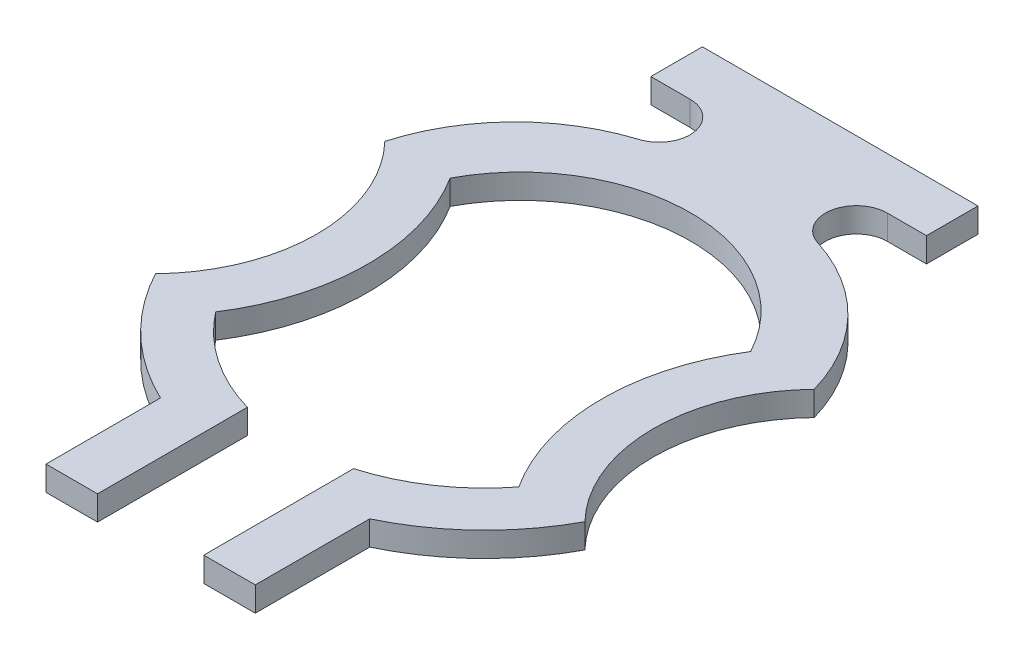
ISO-10303-21;
HEADER;
FILE_DESCRIPTION(('STEP AP214'),'2;1');
FILE_NAME('part.step','',(''),(''),'','','');
FILE_SCHEMA(('AUTOMOTIVE_DESIGN { 1 0 10303 214 1 1 1 1 }'));
ENDSEC;
DATA;
#1=APPLICATION_CONTEXT('core data for automotive mechanical design processes');
#2=APPLICATION_PROTOCOL_DEFINITION('international standard','automotive_design',2000,#1);
#3=PRODUCT_CONTEXT('',#1,'mechanical');
#4=PRODUCT('Part','Part','',(#3));
#5=PRODUCT_RELATED_PRODUCT_CATEGORY('part','',(#4));
#6=PRODUCT_DEFINITION_FORMATION('','',#4);
#7=PRODUCT_DEFINITION_CONTEXT('part definition',#1,'design');
#8=PRODUCT_DEFINITION('design','',#6,#7);
#9=PRODUCT_DEFINITION_SHAPE('','',#8);
#10=(LENGTH_UNIT() NAMED_UNIT(*) SI_UNIT(.MILLI.,.METRE.));
#11=(NAMED_UNIT(*) PLANE_ANGLE_UNIT() SI_UNIT($,.RADIAN.));
#12=(NAMED_UNIT(*) SI_UNIT($,.STERADIAN.) SOLID_ANGLE_UNIT());
#13=UNCERTAINTY_MEASURE_WITH_UNIT(LENGTH_MEASURE(1.E-05),#10,'distance_accuracy_value','');
#14=(GEOMETRIC_REPRESENTATION_CONTEXT(3) GLOBAL_UNCERTAINTY_ASSIGNED_CONTEXT((#13)) GLOBAL_UNIT_ASSIGNED_CONTEXT((#10,
#11,#12)) REPRESENTATION_CONTEXT('',''));
#15=CARTESIAN_POINT('',(0.,0.,0.));
#16=DIRECTION('',(0.,0.,1.));
#17=DIRECTION('',(1.,0.,0.));
#18=AXIS2_PLACEMENT_3D('',#15,#16,#17);
#19=CARTESIAN_POINT('',(0.,0.1,-0.1447));
#20=DIRECTION('',(0.,-1.,0.));
#21=DIRECTION('',(0.,0.,-1.));
#22=AXIS2_PLACEMENT_3D('',#19,#20,#21);
#23=CYLINDRICAL_SURFACE('',#22,0.6938);
#24=CARTESIAN_POINT('',(0.,0.,-0.1447));
#25=DIRECTION('',(0.,-1.,0.));
#26=DIRECTION('',(0.,0.,1.));
#27=AXIS2_PLACEMENT_3D('',#24,#25,#26);
#28=CIRCLE('',#27,0.6938);
#29=CARTESIAN_POINT('',(-0.612334437623996,0.,-0.470897756736163));
#30=VERTEX_POINT('',#29);
#31=CARTESIAN_POINT('',(0.612334437623996,0.,-0.470897756736163));
#32=VERTEX_POINT('',#31);
#33=EDGE_CURVE('E227',#30,#32,#28,.T.);
#34=ORIENTED_EDGE('',*,*,#33,.T.);
#35=DIRECTION('',(0.,-1.,0.));
#36=VECTOR('',#35,1.);
#37=CARTESIAN_POINT('',(0.612334437623996,0.1,-0.470897756736163));
#38=LINE('',#37,#36);
#39=CARTESIAN_POINT('',(0.612334437623996,0.1,-0.470897756736163));
#40=VERTEX_POINT('',#39);
#41=EDGE_CURVE('E11',#40,#32,#38,.T.);
#42=ORIENTED_EDGE('',*,*,#41,.F.);
#43=CARTESIAN_POINT('',(0.,0.1,-0.1447));
#44=DIRECTION('',(0.,-1.,0.));
#45=DIRECTION('',(0.,0.,1.));
#46=AXIS2_PLACEMENT_3D('',#43,#44,#45);
#47=CIRCLE('',#46,0.6938);
#48=CARTESIAN_POINT('',(-0.612334437623996,0.1,-0.470897756736163));
#49=VERTEX_POINT('',#48);
#50=EDGE_CURVE('E273',#49,#40,#47,.T.);
#51=ORIENTED_EDGE('',*,*,#50,.F.);
#52=DIRECTION('',(0.,-1.,0.));
#53=VECTOR('',#52,1.);
#54=CARTESIAN_POINT('',(-0.612334437623996,0.1,-0.470897756736163));
#55=LINE('',#54,#53);
#56=EDGE_CURVE('E223',#49,#30,#55,.T.);
#57=ORIENTED_EDGE('',*,*,#56,.T.);
#58=EDGE_LOOP('',(#34,#42,#51,#57));
#59=FACE_BOUND('',#58,.T.);
#60=ADVANCED_FACE('F35',(#59),#23,.F.);
#61=CARTESIAN_POINT('',(1.3587,0.1,0.));
#62=DIRECTION('',(0.,-1.,0.));
#63=DIRECTION('',(0.,0.,-1.));
#64=AXIS2_PLACEMENT_3D('',#61,#62,#63);
#65=CYLINDRICAL_SURFACE('',#64,0.8825);
#66=CARTESIAN_POINT('',(1.3587,0.,0.));
#67=DIRECTION('',(0.,1.,0.));
#68=DIRECTION('',(0.,0.,1.));
#69=AXIS2_PLACEMENT_3D('',#66,#67,#68);
#70=CIRCLE('',#69,0.8825);
#71=CARTESIAN_POINT('',(0.617847887686759,0.,0.47952517940251));
#72=VERTEX_POINT('',#71);
#73=EDGE_CURVE('E230',#32,#72,#70,.T.);
#74=ORIENTED_EDGE('',*,*,#73,.T.);
#75=DIRECTION('',(0.,-1.,0.));
#76=VECTOR('',#75,1.);
#77=CARTESIAN_POINT('',(0.617847887686759,0.1,0.47952517940251));
#78=LINE('',#77,#76);
#79=CARTESIAN_POINT('',(0.617847887686759,0.1,0.47952517940251));
#80=VERTEX_POINT('',#79);
#81=EDGE_CURVE('E43',#80,#72,#78,.T.);
#82=ORIENTED_EDGE('',*,*,#81,.F.);
#83=CARTESIAN_POINT('',(1.3587,0.1,0.));
#84=DIRECTION('',(0.,1.,0.));
#85=DIRECTION('',(0.,0.,1.));
#86=AXIS2_PLACEMENT_3D('',#83,#84,#85);
#87=CIRCLE('',#86,0.8825);
#88=EDGE_CURVE('E142',#40,#80,#87,.T.);
#89=ORIENTED_EDGE('',*,*,#88,.F.);
#90=ORIENTED_EDGE('',*,*,#41,.T.);
#91=EDGE_LOOP('',(#74,#82,#89,#90));
#92=FACE_BOUND('',#91,.T.);
#93=ADVANCED_FACE('F411',(#92),#65,.T.);
#94=CARTESIAN_POINT('',(0.,0.1,0.));
#95=DIRECTION('',(0.,-1.,0.));
#96=DIRECTION('',(0.,0.,-1.));
#97=AXIS2_PLACEMENT_3D('',#94,#95,#96);
#98=CYLINDRICAL_SURFACE('',#97,0.7821);
#99=CARTESIAN_POINT('',(0.,0.,0.));
#100=DIRECTION('',(0.,-1.,0.));
#101=DIRECTION('',(0.,0.,1.));
#102=AXIS2_PLACEMENT_3D('',#99,#100,#101);
#103=CIRCLE('',#102,0.7821);
#104=CARTESIAN_POINT('',(0.2165,0.,0.751537198014842));
#105=VERTEX_POINT('',#104);
#106=EDGE_CURVE('E232',#72,#105,#103,.T.);
#107=ORIENTED_EDGE('',*,*,#106,.T.);
#108=DIRECTION('',(0.,-1.,0.));
#109=VECTOR('',#108,1.);
#110=CARTESIAN_POINT('',(0.2165,0.1,0.751537198014842));
#111=LINE('',#110,#109);
#112=CARTESIAN_POINT('',(0.2165,0.1,0.751537198014842));
#113=VERTEX_POINT('',#112);
#114=EDGE_CURVE('E328',#113,#105,#111,.T.);
#115=ORIENTED_EDGE('',*,*,#114,.F.);
#116=CARTESIAN_POINT('',(0.,0.1,0.));
#117=DIRECTION('',(0.,-1.,0.));
#118=DIRECTION('',(0.,0.,1.));
#119=AXIS2_PLACEMENT_3D('',#116,#117,#118);
#120=CIRCLE('',#119,0.7821);
#121=EDGE_CURVE('E336',#80,#113,#120,.T.);
#122=ORIENTED_EDGE('',*,*,#121,.F.);
#123=ORIENTED_EDGE('',*,*,#81,.T.);
#124=EDGE_LOOP('',(#107,#115,#122,#123));
#125=FACE_BOUND('',#124,.T.);
#126=ADVANCED_FACE('F334',(#125),#98,.F.);
#127=CARTESIAN_POINT('',(0.2165,0.1,0.751537198014842));
#128=DIRECTION('',(1.,0.,0.));
#129=DIRECTION('',(0.,0.,-1.));
#130=AXIS2_PLACEMENT_3D('',#127,#128,#129);
#131=PLANE('',#130);
#132=DIRECTION('',(0.,0.,1.));
#133=VECTOR('',#132,1.);
#134=CARTESIAN_POINT('',(0.2165,0.,0.751537198014842));
#135=LINE('',#134,#133);
#136=CARTESIAN_POINT('',(0.216499999999953,0.,1.3623));
#137=VERTEX_POINT('',#136);
#138=EDGE_CURVE('E234',#105,#137,#135,.T.);
#139=ORIENTED_EDGE('',*,*,#138,.T.);
#140=DIRECTION('',(0.,-1.,0.));
#141=VECTOR('',#140,1.);
#142=CARTESIAN_POINT('',(0.216499999999953,0.1,1.3623));
#143=LINE('',#142,#141);
#144=CARTESIAN_POINT('',(0.216499999999953,0.1,1.3623));
#145=VERTEX_POINT('',#144);
#146=EDGE_CURVE('E325',#145,#137,#143,.T.);
#147=ORIENTED_EDGE('',*,*,#146,.F.);
#148=DIRECTION('',(0.,0.,1.));
#149=VECTOR('',#148,1.);
#150=CARTESIAN_POINT('',(0.2165,0.1,0.751537198014842));
#151=LINE('',#150,#149);
#152=EDGE_CURVE('E354',#113,#145,#151,.T.);
#153=ORIENTED_EDGE('',*,*,#152,.F.);
#154=ORIENTED_EDGE('',*,*,#114,.T.);
#155=EDGE_LOOP('',(#139,#147,#153,#154));
#156=FACE_BOUND('',#155,.T.);
#157=ADVANCED_FACE('F345',(#156),#131,.F.);
#158=CARTESIAN_POINT('',(0.216499999999953,0.1,1.3623));
#159=DIRECTION('',(0.,0.,-1.));
#160=DIRECTION('',(-1.,0.,0.));
#161=AXIS2_PLACEMENT_3D('',#158,#159,#160);
#162=PLANE('',#161);
#163=DIRECTION('',(1.,0.,0.));
#164=VECTOR('',#163,1.);
#165=CARTESIAN_POINT('',(0.216499999999953,0.,1.3623));
#166=LINE('',#165,#164);
#167=CARTESIAN_POINT('',(0.4265,0.,1.3623));
#168=VERTEX_POINT('',#167);
#169=EDGE_CURVE('E236',#137,#168,#166,.T.);
#170=ORIENTED_EDGE('',*,*,#169,.T.);
#171=DIRECTION('',(0.,-1.,0.));
#172=VECTOR('',#171,1.);
#173=CARTESIAN_POINT('',(0.4265,0.1,1.3623));
#174=LINE('',#173,#172);
#175=CARTESIAN_POINT('',(0.4265,0.1,1.3623));
#176=VERTEX_POINT('',#175);
#177=EDGE_CURVE('E322',#176,#168,#174,.T.);
#178=ORIENTED_EDGE('',*,*,#177,.F.);
#179=DIRECTION('',(1.,0.,0.));
#180=VECTOR('',#179,1.);
#181=CARTESIAN_POINT('',(0.216499999999953,0.1,1.3623));
#182=LINE('',#181,#180);
#183=EDGE_CURVE('E351',#145,#176,#182,.T.);
#184=ORIENTED_EDGE('',*,*,#183,.F.);
#185=ORIENTED_EDGE('',*,*,#146,.T.);
#186=EDGE_LOOP('',(#170,#178,#184,#185));
#187=FACE_BOUND('',#186,.T.);
#188=ADVANCED_FACE('F349',(#187),#162,.F.);
#189=CARTESIAN_POINT('',(0.4265,0.1,1.3623));
#190=DIRECTION('',(-1.,0.,0.));
#191=DIRECTION('',(0.,0.,1.));
#192=AXIS2_PLACEMENT_3D('',#189,#190,#191);
#193=PLANE('',#192);
#194=DIRECTION('',(0.,0.,-1.));
#195=VECTOR('',#194,1.);
#196=CARTESIAN_POINT('',(0.4265,0.,1.3623));
#197=LINE('',#196,#195);
#198=CARTESIAN_POINT('',(0.4265,0.,0.895745588881129));
#199=VERTEX_POINT('',#198);
#200=EDGE_CURVE('E238',#168,#199,#197,.T.);
#201=ORIENTED_EDGE('',*,*,#200,.T.);
#202=DIRECTION('',(0.,-1.,0.));
#203=VECTOR('',#202,1.);
#204=CARTESIAN_POINT('',(0.4265,0.1,0.895745588881129));
#205=LINE('',#204,#203);
#206=CARTESIAN_POINT('',(0.4265,0.1,0.895745588881129));
#207=VERTEX_POINT('',#206);
#208=EDGE_CURVE('E319',#207,#199,#205,.T.);
#209=ORIENTED_EDGE('',*,*,#208,.F.);
#210=DIRECTION('',(0.,0.,-1.));
#211=VECTOR('',#210,1.);
#212=CARTESIAN_POINT('',(0.4265,0.1,1.3623));
#213=LINE('',#212,#211);
#214=EDGE_CURVE('E353',#176,#207,#213,.T.);
#215=ORIENTED_EDGE('',*,*,#214,.F.);
#216=ORIENTED_EDGE('',*,*,#177,.T.);
#217=EDGE_LOOP('',(#201,#209,#215,#216));
#218=FACE_BOUND('',#217,.T.);
#219=ADVANCED_FACE('F424',(#218),#193,.F.);
#220=CARTESIAN_POINT('',(0.,0.1,0.));
#221=DIRECTION('',(0.,-1.,0.));
#222=DIRECTION('',(0.,0.,-1.));
#223=AXIS2_PLACEMENT_3D('',#220,#221,#222);
#224=CYLINDRICAL_SURFACE('',#223,0.9921);
#225=CARTESIAN_POINT('',(0.,0.,0.));
#226=DIRECTION('',(0.,1.,0.));
#227=DIRECTION('',(0.,0.,1.));
#228=AXIS2_PLACEMENT_3D('',#225,#226,#227);
#229=CIRCLE('',#228,0.9921);
#230=CARTESIAN_POINT('',(0.875127640391551,0.,0.467347860830363));
#231=VERTEX_POINT('',#230);
#232=EDGE_CURVE('E240',#199,#231,#229,.T.);
#233=ORIENTED_EDGE('',*,*,#232,.T.);
#234=DIRECTION('',(0.,-1.,0.));
#235=VECTOR('',#234,1.);
#236=CARTESIAN_POINT('',(0.875127640391551,0.1,0.467347860830363));
#237=LINE('',#236,#235);
#238=CARTESIAN_POINT('',(0.875127640391551,0.1,0.467347860830363));
#239=VERTEX_POINT('',#238);
#240=EDGE_CURVE('E316',#239,#231,#237,.T.);
#241=ORIENTED_EDGE('',*,*,#240,.F.);
#242=CARTESIAN_POINT('',(0.,0.1,0.));
#243=DIRECTION('',(0.,1.,0.));
#244=DIRECTION('',(0.,0.,1.));
#245=AXIS2_PLACEMENT_3D('',#242,#243,#244);
#246=CIRCLE('',#245,0.9921);
#247=EDGE_CURVE('E356',#207,#239,#246,.T.);
#248=ORIENTED_EDGE('',*,*,#247,.F.);
#249=ORIENTED_EDGE('',*,*,#208,.T.);
#250=EDGE_LOOP('',(#233,#241,#248,#249));
#251=FACE_BOUND('',#250,.T.);
#252=ADVANCED_FACE('F427',(#251),#224,.T.);
#253=CARTESIAN_POINT('',(1.3587,0.1,0.));
#254=DIRECTION('',(0.,-1.,0.));
#255=DIRECTION('',(0.,0.,-1.));
#256=AXIS2_PLACEMENT_3D('',#253,#254,#255);
#257=CYLINDRICAL_SURFACE('',#256,0.6725);
#258=CARTESIAN_POINT('',(1.3587,0.,0.));
#259=DIRECTION('',(0.,-1.,0.));
#260=DIRECTION('',(0.,0.,1.));
#261=AXIS2_PLACEMENT_3D('',#258,#259,#260);
#262=CIRCLE('',#261,0.6725);
#263=CARTESIAN_POINT('',(0.875117893320699,0.,-0.467337775168678));
#264=VERTEX_POINT('',#263);
#265=EDGE_CURVE('E242',#231,#264,#262,.T.);
#266=ORIENTED_EDGE('',*,*,#265,.T.);
#267=DIRECTION('',(0.,-1.,0.));
#268=VECTOR('',#267,1.);
#269=CARTESIAN_POINT('',(0.875117893320699,0.1,-0.467337775168678));
#270=LINE('',#269,#268);
#271=CARTESIAN_POINT('',(0.875117893320699,0.1,-0.467337775168678));
#272=VERTEX_POINT('',#271);
#273=EDGE_CURVE('E313',#272,#264,#270,.T.);
#274=ORIENTED_EDGE('',*,*,#273,.F.);
#275=CARTESIAN_POINT('',(1.3587,0.1,0.));
#276=DIRECTION('',(0.,-1.,0.));
#277=DIRECTION('',(0.,0.,1.));
#278=AXIS2_PLACEMENT_3D('',#275,#276,#277);
#279=CIRCLE('',#278,0.6725);
#280=EDGE_CURVE('E362',#239,#272,#279,.T.);
#281=ORIENTED_EDGE('',*,*,#280,.F.);
#282=ORIENTED_EDGE('',*,*,#240,.T.);
#283=EDGE_LOOP('',(#266,#274,#281,#282));
#284=FACE_BOUND('',#283,.T.);
#285=ADVANCED_FACE('F431',(#284),#257,.F.);
#286=CARTESIAN_POINT('',(0.132599999999927,0.1,-0.2553));
#287=DIRECTION('',(0.,-1.,0.));
#288=DIRECTION('',(0.,0.,-1.));
#289=AXIS2_PLACEMENT_3D('',#286,#287,#288);
#290=CYLINDRICAL_SURFACE('',#289,0.7722);
#291=CARTESIAN_POINT('',(0.132599999999927,0.,-0.2553));
#292=DIRECTION('',(0.,1.,0.));
#293=DIRECTION('',(0.,0.,1.));
#294=AXIS2_PLACEMENT_3D('',#291,#292,#293);
#295=CIRCLE('',#294,0.7722);
#296=CARTESIAN_POINT('',(0.364324457071019,0.,-0.991911577424023));
#297=VERTEX_POINT('',#296);
#298=EDGE_CURVE('E244',#264,#297,#295,.T.);
#299=ORIENTED_EDGE('',*,*,#298,.T.);
#300=DIRECTION('',(0.,-1.,0.));
#301=VECTOR('',#300,1.);
#302=CARTESIAN_POINT('',(0.364324457071019,0.1,-0.991911577424023));
#303=LINE('',#302,#301);
#304=CARTESIAN_POINT('',(0.364324457071019,0.1,-0.991911577424023));
#305=VERTEX_POINT('',#304);
#306=EDGE_CURVE('E310',#305,#297,#303,.T.);
#307=ORIENTED_EDGE('',*,*,#306,.F.);
#308=CARTESIAN_POINT('',(0.132599999999927,0.1,-0.2553));
#309=DIRECTION('',(0.,1.,0.));
#310=DIRECTION('',(0.,0.,1.));
#311=AXIS2_PLACEMENT_3D('',#308,#309,#310);
#312=CIRCLE('',#311,0.7722);
#313=EDGE_CURVE('E364',#272,#305,#312,.T.);
#314=ORIENTED_EDGE('',*,*,#313,.F.);
#315=ORIENTED_EDGE('',*,*,#273,.T.);
#316=EDGE_LOOP('',(#299,#307,#314,#315));
#317=FACE_BOUND('',#316,.T.);
#318=ADVANCED_FACE('F435',(#317),#290,.T.);
#319=CARTESIAN_POINT('',(0.402164982889026,0.1,-1.1122));
#320=DIRECTION('',(0.,-1.,0.));
#321=DIRECTION('',(0.,0.,-1.));
#322=AXIS2_PLACEMENT_3D('',#319,#320,#321);
#323=CYLINDRICAL_SURFACE('',#322,0.1261);
#324=CARTESIAN_POINT('',(0.402164982889026,0.,-1.1122));
#325=DIRECTION('',(0.,-1.,0.));
#326=DIRECTION('',(0.,0.,1.));
#327=AXIS2_PLACEMENT_3D('',#324,#325,#326);
#328=CIRCLE('',#327,0.1261);
#329=CARTESIAN_POINT('',(0.402164982889026,0.,-1.2383));
#330=VERTEX_POINT('',#329);
#331=EDGE_CURVE('E246',#297,#330,#328,.T.);
#332=ORIENTED_EDGE('',*,*,#331,.T.);
#333=DIRECTION('',(0.,-1.,0.));
#334=VECTOR('',#333,1.);
#335=CARTESIAN_POINT('',(0.402164982889026,0.1,-1.2383));
#336=LINE('',#335,#334);
#337=CARTESIAN_POINT('',(0.402164982889026,0.1,-1.2383));
#338=VERTEX_POINT('',#337);
#339=EDGE_CURVE('E307',#338,#330,#336,.T.);
#340=ORIENTED_EDGE('',*,*,#339,.F.);
#341=CARTESIAN_POINT('',(0.402164982889026,0.1,-1.1122));
#342=DIRECTION('',(0.,-1.,0.));
#343=DIRECTION('',(0.,0.,1.));
#344=AXIS2_PLACEMENT_3D('',#341,#342,#343);
#345=CIRCLE('',#344,0.1261);
#346=EDGE_CURVE('E366',#305,#338,#345,.T.);
#347=ORIENTED_EDGE('',*,*,#346,.F.);
#348=ORIENTED_EDGE('',*,*,#306,.T.);
#349=EDGE_LOOP('',(#332,#340,#347,#348));
#350=FACE_BOUND('',#349,.T.);
#351=ADVANCED_FACE('F439',(#350),#323,.F.);
#352=CARTESIAN_POINT('',(0.402164982889026,0.1,-1.2383));
#353=DIRECTION('',(0.,0.,-1.));
#354=DIRECTION('',(-1.,0.,0.));
#355=AXIS2_PLACEMENT_3D('',#352,#353,#354);
#356=PLANE('',#355);
#357=DIRECTION('',(1.,0.,0.));
#358=VECTOR('',#357,1.);
#359=CARTESIAN_POINT('',(0.402164982889026,0.,-1.2383));
#360=LINE('',#359,#358);
#361=CARTESIAN_POINT('',(0.561699999996508,0.,-1.2383));
#362=VERTEX_POINT('',#361);
#363=EDGE_CURVE('E248',#330,#362,#360,.T.);
#364=ORIENTED_EDGE('',*,*,#363,.T.);
#365=DIRECTION('',(0.,-1.,0.));
#366=VECTOR('',#365,1.);
#367=CARTESIAN_POINT('',(0.561699999996508,0.1,-1.2383));
#368=LINE('',#367,#366);
#369=CARTESIAN_POINT('',(0.561699999996508,0.1,-1.2383));
#370=VERTEX_POINT('',#369);
#371=EDGE_CURVE('E304',#370,#362,#368,.T.);
#372=ORIENTED_EDGE('',*,*,#371,.F.);
#373=DIRECTION('',(1.,0.,0.));
#374=VECTOR('',#373,1.);
#375=CARTESIAN_POINT('',(0.402164982889026,0.1,-1.2383));
#376=LINE('',#375,#374);
#377=EDGE_CURVE('E368',#338,#370,#376,.T.);
#378=ORIENTED_EDGE('',*,*,#377,.F.);
#379=ORIENTED_EDGE('',*,*,#339,.T.);
#380=EDGE_LOOP('',(#364,#372,#378,#379));
#381=FACE_BOUND('',#380,.T.);
#382=ADVANCED_FACE('F443',(#381),#356,.F.);
#383=CARTESIAN_POINT('',(0.561699999999998,0.1,-1.4483));
#384=DIRECTION('',(-1.,0.,-1.66182378704588E-11));
#385=DIRECTION('',(-1.66182378704588E-11,0.,1.));
#386=AXIS2_PLACEMENT_3D('',#383,#384,#385);
#387=PLANE('',#386);
#388=DIRECTION('',(1.66182378704588E-11,0.,-1.));
#389=VECTOR('',#388,1.);
#390=CARTESIAN_POINT('',(0.561699999999998,0.,-1.4483));
#391=LINE('',#390,#389);
#392=CARTESIAN_POINT('',(0.561699999999998,0.,-1.4483));
#393=VERTEX_POINT('',#392);
#394=EDGE_CURVE('E250',#362,#393,#391,.T.);
#395=ORIENTED_EDGE('',*,*,#394,.T.);
#396=DIRECTION('',(0.,-1.,0.));
#397=VECTOR('',#396,1.);
#398=CARTESIAN_POINT('',(0.561699999999998,0.1,-1.4483));
#399=LINE('',#398,#397);
#400=CARTESIAN_POINT('',(0.561699999999998,0.1,-1.4483));
#401=VERTEX_POINT('',#400);
#402=EDGE_CURVE('E301',#401,#393,#399,.T.);
#403=ORIENTED_EDGE('',*,*,#402,.F.);
#404=DIRECTION('',(1.66182378704588E-11,0.,-1.));
#405=VECTOR('',#404,1.);
#406=CARTESIAN_POINT('',(0.561699999999998,0.1,-1.4483));
#407=LINE('',#406,#405);
#408=EDGE_CURVE('E370',#370,#401,#407,.T.);
#409=ORIENTED_EDGE('',*,*,#408,.F.);
#410=ORIENTED_EDGE('',*,*,#371,.T.);
#411=EDGE_LOOP('',(#395,#403,#409,#410));
#412=FACE_BOUND('',#411,.T.);
#413=ADVANCED_FACE('F447',(#412),#387,.F.);
#414=CARTESIAN_POINT('',(-0.561699999999998,0.1,-1.4483));
#415=DIRECTION('',(0.,0.,1.));
#416=DIRECTION('',(1.,0.,0.));
#417=AXIS2_PLACEMENT_3D('',#414,#415,#416);
#418=PLANE('',#417);
#419=DIRECTION('',(-1.,0.,0.));
#420=VECTOR('',#419,1.);
#421=CARTESIAN_POINT('',(-0.561699999999998,0.,-1.4483));
#422=LINE('',#421,#420);
#423=CARTESIAN_POINT('',(-0.561699999999998,0.,-1.4483));
#424=VERTEX_POINT('',#423);
#425=EDGE_CURVE('E252',#393,#424,#422,.T.);
#426=ORIENTED_EDGE('',*,*,#425,.T.);
#427=DIRECTION('',(0.,-1.,0.));
#428=VECTOR('',#427,1.);
#429=CARTESIAN_POINT('',(-0.561699999999998,0.1,-1.4483));
#430=LINE('',#429,#428);
#431=CARTESIAN_POINT('',(-0.561699999999998,0.1,-1.4483));
#432=VERTEX_POINT('',#431);
#433=EDGE_CURVE('E298',#432,#424,#430,.T.);
#434=ORIENTED_EDGE('',*,*,#433,.F.);
#435=DIRECTION('',(-1.,0.,0.));
#436=VECTOR('',#435,1.);
#437=CARTESIAN_POINT('',(-0.561699999999998,0.1,-1.4483));
#438=LINE('',#437,#436);
#439=EDGE_CURVE('E372',#401,#432,#438,.T.);
#440=ORIENTED_EDGE('',*,*,#439,.F.);
#441=ORIENTED_EDGE('',*,*,#402,.T.);
#442=EDGE_LOOP('',(#426,#434,#440,#441));
#443=FACE_BOUND('',#442,.T.);
#444=ADVANCED_FACE('F451',(#443),#418,.F.);
#445=CARTESIAN_POINT('',(-0.561699999999998,0.1,-1.4483));
#446=DIRECTION('',(1.,0.,-1.66182378704588E-11));
#447=DIRECTION('',(-1.66182378704588E-11,0.,-1.));
#448=AXIS2_PLACEMENT_3D('',#445,#446,#447);
#449=PLANE('',#448);
#450=DIRECTION('',(1.66182378704588E-11,0.,1.));
#451=VECTOR('',#450,1.);
#452=CARTESIAN_POINT('',(-0.561699999999998,0.,-1.4483));
#453=LINE('',#452,#451);
#454=CARTESIAN_POINT('',(-0.561699999996508,0.,-1.2383));
#455=VERTEX_POINT('',#454);
#456=EDGE_CURVE('E254',#424,#455,#453,.T.);
#457=ORIENTED_EDGE('',*,*,#456,.T.);
#458=DIRECTION('',(0.,-1.,0.));
#459=VECTOR('',#458,1.);
#460=CARTESIAN_POINT('',(-0.561699999996508,0.1,-1.2383));
#461=LINE('',#460,#459);
#462=CARTESIAN_POINT('',(-0.561699999996508,0.1,-1.2383));
#463=VERTEX_POINT('',#462);
#464=EDGE_CURVE('E295',#463,#455,#461,.T.);
#465=ORIENTED_EDGE('',*,*,#464,.F.);
#466=DIRECTION('',(1.66182378704588E-11,0.,1.));
#467=VECTOR('',#466,1.);
#468=CARTESIAN_POINT('',(-0.561699999999998,0.1,-1.4483));
#469=LINE('',#468,#467);
#470=EDGE_CURVE('E374',#432,#463,#469,.T.);
#471=ORIENTED_EDGE('',*,*,#470,.F.);
#472=ORIENTED_EDGE('',*,*,#433,.T.);
#473=EDGE_LOOP('',(#457,#465,#471,#472));
#474=FACE_BOUND('',#473,.T.);
#475=ADVANCED_FACE('F455',(#474),#449,.F.);
#476=CARTESIAN_POINT('',(-0.402164982889026,0.1,-1.2383));
#477=DIRECTION('',(0.,0.,-1.));
#478=DIRECTION('',(-1.,0.,0.));
#479=AXIS2_PLACEMENT_3D('',#476,#477,#478);
#480=PLANE('',#479);
#481=DIRECTION('',(1.,0.,0.));
#482=VECTOR('',#481,1.);
#483=CARTESIAN_POINT('',(-0.402164982889026,0.,-1.2383));
#484=LINE('',#483,#482);
#485=CARTESIAN_POINT('',(-0.402164982889026,0.,-1.2383));
#486=VERTEX_POINT('',#485);
#487=EDGE_CURVE('E256',#455,#486,#484,.T.);
#488=ORIENTED_EDGE('',*,*,#487,.T.);
#489=DIRECTION('',(0.,-1.,0.));
#490=VECTOR('',#489,1.);
#491=CARTESIAN_POINT('',(-0.402164982889026,0.1,-1.2383));
#492=LINE('',#491,#490);
#493=CARTESIAN_POINT('',(-0.402164982889026,0.1,-1.2383));
#494=VERTEX_POINT('',#493);
#495=EDGE_CURVE('E292',#494,#486,#492,.T.);
#496=ORIENTED_EDGE('',*,*,#495,.F.);
#497=DIRECTION('',(1.,0.,0.));
#498=VECTOR('',#497,1.);
#499=CARTESIAN_POINT('',(-0.402164982889026,0.1,-1.2383));
#500=LINE('',#499,#498);
#501=EDGE_CURVE('E376',#463,#494,#500,.T.);
#502=ORIENTED_EDGE('',*,*,#501,.F.);
#503=ORIENTED_EDGE('',*,*,#464,.T.);
#504=EDGE_LOOP('',(#488,#496,#502,#503));
#505=FACE_BOUND('',#504,.T.);
#506=ADVANCED_FACE('F459',(#505),#480,.F.);
#507=CARTESIAN_POINT('',(-0.402164982889026,0.1,-1.1122));
#508=DIRECTION('',(0.,-1.,0.));
#509=DIRECTION('',(0.,0.,-1.));
#510=AXIS2_PLACEMENT_3D('',#507,#508,#509);
#511=CYLINDRICAL_SURFACE('',#510,0.1261);
#512=CARTESIAN_POINT('',(-0.402164982889026,0.,-1.1122));
#513=DIRECTION('',(0.,-1.,0.));
#514=DIRECTION('',(0.,0.,-1.));
#515=AXIS2_PLACEMENT_3D('',#512,#513,#514);
#516=CIRCLE('',#515,0.1261);
#517=CARTESIAN_POINT('',(-0.36432445707102,0.,-0.991911577424023));
#518=VERTEX_POINT('',#517);
#519=EDGE_CURVE('E258',#486,#518,#516,.T.);
#520=ORIENTED_EDGE('',*,*,#519,.T.);
#521=DIRECTION('',(0.,-1.,0.));
#522=VECTOR('',#521,1.);
#523=CARTESIAN_POINT('',(-0.36432445707102,0.1,-0.991911577424023));
#524=LINE('',#523,#522);
#525=CARTESIAN_POINT('',(-0.36432445707102,0.1,-0.991911577424023));
#526=VERTEX_POINT('',#525);
#527=EDGE_CURVE('E289',#526,#518,#524,.T.);
#528=ORIENTED_EDGE('',*,*,#527,.F.);
#529=CARTESIAN_POINT('',(-0.402164982889026,0.1,-1.1122));
#530=DIRECTION('',(0.,-1.,0.));
#531=DIRECTION('',(0.,0.,-1.));
#532=AXIS2_PLACEMENT_3D('',#529,#530,#531);
#533=CIRCLE('',#532,0.1261);
#534=EDGE_CURVE('E378',#494,#526,#533,.T.);
#535=ORIENTED_EDGE('',*,*,#534,.F.);
#536=ORIENTED_EDGE('',*,*,#495,.T.);
#537=EDGE_LOOP('',(#520,#528,#535,#536));
#538=FACE_BOUND('',#537,.T.);
#539=ADVANCED_FACE('F463',(#538),#511,.F.);
#540=CARTESIAN_POINT('',(-0.132599999999927,0.1,-0.2553));
#541=DIRECTION('',(0.,-1.,0.));
#542=DIRECTION('',(0.,0.,-1.));
#543=AXIS2_PLACEMENT_3D('',#540,#541,#542);
#544=CYLINDRICAL_SURFACE('',#543,0.7722);
#545=CARTESIAN_POINT('',(-0.132599999999927,0.,-0.2553));
#546=DIRECTION('',(0.,1.,0.));
#547=DIRECTION('',(0.,0.,-1.));
#548=AXIS2_PLACEMENT_3D('',#545,#546,#547);
#549=CIRCLE('',#548,0.7722);
#550=CARTESIAN_POINT('',(-0.875117893320699,0.,-0.467337775168678));
#551=VERTEX_POINT('',#550);
#552=EDGE_CURVE('E260',#518,#551,#549,.T.);
#553=ORIENTED_EDGE('',*,*,#552,.T.);
#554=DIRECTION('',(0.,-1.,0.));
#555=VECTOR('',#554,1.);
#556=CARTESIAN_POINT('',(-0.875117893320699,0.1,-0.467337775168678));
#557=LINE('',#556,#555);
#558=CARTESIAN_POINT('',(-0.875117893320699,0.1,-0.467337775168678));
#559=VERTEX_POINT('',#558);
#560=EDGE_CURVE('E286',#559,#551,#557,.T.);
#561=ORIENTED_EDGE('',*,*,#560,.F.);
#562=CARTESIAN_POINT('',(-0.132599999999927,0.1,-0.2553));
#563=DIRECTION('',(0.,1.,0.));
#564=DIRECTION('',(0.,0.,-1.));
#565=AXIS2_PLACEMENT_3D('',#562,#563,#564);
#566=CIRCLE('',#565,0.7722);
#567=EDGE_CURVE('E380',#526,#559,#566,.T.);
#568=ORIENTED_EDGE('',*,*,#567,.F.);
#569=ORIENTED_EDGE('',*,*,#527,.T.);
#570=EDGE_LOOP('',(#553,#561,#568,#569));
#571=FACE_BOUND('',#570,.T.);
#572=ADVANCED_FACE('F467',(#571),#544,.T.);
#573=CARTESIAN_POINT('',(-1.3587,0.1,0.));
#574=DIRECTION('',(0.,-1.,0.));
#575=DIRECTION('',(0.,0.,-1.));
#576=AXIS2_PLACEMENT_3D('',#573,#574,#575);
#577=CYLINDRICAL_SURFACE('',#576,0.6725);
#578=CARTESIAN_POINT('',(-1.3587,0.,0.));
#579=DIRECTION('',(0.,-1.,0.));
#580=DIRECTION('',(0.,0.,-1.));
#581=AXIS2_PLACEMENT_3D('',#578,#579,#580);
#582=CIRCLE('',#581,0.6725);
#583=CARTESIAN_POINT('',(-0.875127640391551,0.,0.467347860830364));
#584=VERTEX_POINT('',#583);
#585=EDGE_CURVE('E262',#551,#584,#582,.T.);
#586=ORIENTED_EDGE('',*,*,#585,.T.);
#587=DIRECTION('',(0.,-1.,0.));
#588=VECTOR('',#587,1.);
#589=CARTESIAN_POINT('',(-0.875127640391551,0.1,0.467347860830364));
#590=LINE('',#589,#588);
#591=CARTESIAN_POINT('',(-0.875127640391551,0.1,0.467347860830364));
#592=VERTEX_POINT('',#591);
#593=EDGE_CURVE('E283',#592,#584,#590,.T.);
#594=ORIENTED_EDGE('',*,*,#593,.F.);
#595=CARTESIAN_POINT('',(-1.3587,0.1,0.));
#596=DIRECTION('',(0.,-1.,0.));
#597=DIRECTION('',(0.,0.,-1.));
#598=AXIS2_PLACEMENT_3D('',#595,#596,#597);
#599=CIRCLE('',#598,0.6725);
#600=EDGE_CURVE('E382',#559,#592,#599,.T.);
#601=ORIENTED_EDGE('',*,*,#600,.F.);
#602=ORIENTED_EDGE('',*,*,#560,.T.);
#603=EDGE_LOOP('',(#586,#594,#601,#602));
#604=FACE_BOUND('',#603,.T.);
#605=ADVANCED_FACE('F471',(#604),#577,.F.);
#606=CARTESIAN_POINT('',(0.,0.1,0.));
#607=DIRECTION('',(0.,-1.,0.));
#608=DIRECTION('',(0.,0.,-1.));
#609=AXIS2_PLACEMENT_3D('',#606,#607,#608);
#610=CYLINDRICAL_SURFACE('',#609,0.9921);
#611=CARTESIAN_POINT('',(0.,0.,0.));
#612=DIRECTION('',(0.,1.,0.));
#613=DIRECTION('',(0.,0.,-1.));
#614=AXIS2_PLACEMENT_3D('',#611,#612,#613);
#615=CIRCLE('',#614,0.9921);
#616=CARTESIAN_POINT('',(-0.4265,0.,0.895745588881129));
#617=VERTEX_POINT('',#616);
#618=EDGE_CURVE('E264',#584,#617,#615,.T.);
#619=ORIENTED_EDGE('',*,*,#618,.T.);
#620=DIRECTION('',(0.,-1.,0.));
#621=VECTOR('',#620,1.);
#622=CARTESIAN_POINT('',(-0.4265,0.1,0.895745588881129));
#623=LINE('',#622,#621);
#624=CARTESIAN_POINT('',(-0.4265,0.1,0.895745588881129));
#625=VERTEX_POINT('',#624);
#626=EDGE_CURVE('E280',#625,#617,#623,.T.);
#627=ORIENTED_EDGE('',*,*,#626,.F.);
#628=CARTESIAN_POINT('',(0.,0.1,0.));
#629=DIRECTION('',(0.,1.,0.));
#630=DIRECTION('',(0.,0.,-1.));
#631=AXIS2_PLACEMENT_3D('',#628,#629,#630);
#632=CIRCLE('',#631,0.9921);
#633=EDGE_CURVE('E384',#592,#625,#632,.T.);
#634=ORIENTED_EDGE('',*,*,#633,.F.);
#635=ORIENTED_EDGE('',*,*,#593,.T.);
#636=EDGE_LOOP('',(#619,#627,#634,#635));
#637=FACE_BOUND('',#636,.T.);
#638=ADVANCED_FACE('F475',(#637),#610,.T.);
#639=CARTESIAN_POINT('',(-0.4265,0.1,1.3623));
#640=DIRECTION('',(1.,0.,0.));
#641=DIRECTION('',(0.,0.,-1.));
#642=AXIS2_PLACEMENT_3D('',#639,#640,#641);
#643=PLANE('',#642);
#644=DIRECTION('',(0.,0.,1.));
#645=VECTOR('',#644,1.);
#646=CARTESIAN_POINT('',(-0.4265,0.,1.3623));
#647=LINE('',#646,#645);
#648=CARTESIAN_POINT('',(-0.4265,0.,1.3623));
#649=VERTEX_POINT('',#648);
#650=EDGE_CURVE('E266',#617,#649,#647,.T.);
#651=ORIENTED_EDGE('',*,*,#650,.T.);
#652=DIRECTION('',(0.,-1.,0.));
#653=VECTOR('',#652,1.);
#654=CARTESIAN_POINT('',(-0.4265,0.1,1.3623));
#655=LINE('',#654,#653);
#656=CARTESIAN_POINT('',(-0.4265,0.1,1.3623));
#657=VERTEX_POINT('',#656);
#658=EDGE_CURVE('E277',#657,#649,#655,.T.);
#659=ORIENTED_EDGE('',*,*,#658,.F.);
#660=DIRECTION('',(0.,0.,1.));
#661=VECTOR('',#660,1.);
#662=CARTESIAN_POINT('',(-0.4265,0.1,1.3623));
#663=LINE('',#662,#661);
#664=EDGE_CURVE('E386',#625,#657,#663,.T.);
#665=ORIENTED_EDGE('',*,*,#664,.F.);
#666=ORIENTED_EDGE('',*,*,#626,.T.);
#667=EDGE_LOOP('',(#651,#659,#665,#666));
#668=FACE_BOUND('',#667,.T.);
#669=ADVANCED_FACE('F392',(#668),#643,.F.);
#670=CARTESIAN_POINT('',(-0.216499999999953,0.1,1.3623));
#671=DIRECTION('',(0.,0.,-1.));
#672=DIRECTION('',(-1.,0.,0.));
#673=AXIS2_PLACEMENT_3D('',#670,#671,#672);
#674=PLANE('',#673);
#675=DIRECTION('',(1.,0.,0.));
#676=VECTOR('',#675,1.);
#677=CARTESIAN_POINT('',(-0.216499999999953,0.,1.3623));
#678=LINE('',#677,#676);
#679=CARTESIAN_POINT('',(-0.216499999999953,0.,1.3623));
#680=VERTEX_POINT('',#679);
#681=EDGE_CURVE('E268',#649,#680,#678,.T.);
#682=ORIENTED_EDGE('',*,*,#681,.T.);
#683=DIRECTION('',(0.,-1.,0.));
#684=VECTOR('',#683,1.);
#685=CARTESIAN_POINT('',(-0.216499999999953,0.1,1.3623));
#686=LINE('',#685,#684);
#687=CARTESIAN_POINT('',(-0.216499999999953,0.1,1.3623));
#688=VERTEX_POINT('',#687);
#689=EDGE_CURVE('E218',#688,#680,#686,.T.);
#690=ORIENTED_EDGE('',*,*,#689,.F.);
#691=DIRECTION('',(1.,0.,0.));
#692=VECTOR('',#691,1.);
#693=CARTESIAN_POINT('',(-0.216499999999953,0.1,1.3623));
#694=LINE('',#693,#692);
#695=EDGE_CURVE('E209',#657,#688,#694,.T.);
#696=ORIENTED_EDGE('',*,*,#695,.F.);
#697=ORIENTED_EDGE('',*,*,#658,.T.);
#698=EDGE_LOOP('',(#682,#690,#696,#697));
#699=FACE_BOUND('',#698,.T.);
#700=ADVANCED_FACE('F396',(#699),#674,.F.);
#701=CARTESIAN_POINT('',(-0.2165,0.1,0.751537198014842));
#702=DIRECTION('',(-1.,0.,0.));
#703=DIRECTION('',(0.,0.,1.));
#704=AXIS2_PLACEMENT_3D('',#701,#702,#703);
#705=PLANE('',#704);
#706=DIRECTION('',(0.,0.,-1.));
#707=VECTOR('',#706,1.);
#708=CARTESIAN_POINT('',(-0.2165,0.,0.751537198014842));
#709=LINE('',#708,#707);
#710=CARTESIAN_POINT('',(-0.2165,0.,0.751537198014842));
#711=VERTEX_POINT('',#710);
#712=EDGE_CURVE('E217',#680,#711,#709,.T.);
#713=ORIENTED_EDGE('',*,*,#712,.T.);
#714=DIRECTION('',(0.,-1.,0.));
#715=VECTOR('',#714,1.);
#716=CARTESIAN_POINT('',(-0.2165,0.1,0.751537198014842));
#717=LINE('',#716,#715);
#718=CARTESIAN_POINT('',(-0.2165,0.1,0.751537198014842));
#719=VERTEX_POINT('',#718);
#720=EDGE_CURVE('E214',#719,#711,#717,.T.);
#721=ORIENTED_EDGE('',*,*,#720,.F.);
#722=DIRECTION('',(0.,0.,-1.));
#723=VECTOR('',#722,1.);
#724=CARTESIAN_POINT('',(-0.2165,0.1,0.751537198014842));
#725=LINE('',#724,#723);
#726=EDGE_CURVE('E203',#688,#719,#725,.T.);
#727=ORIENTED_EDGE('',*,*,#726,.F.);
#728=ORIENTED_EDGE('',*,*,#689,.T.);
#729=EDGE_LOOP('',(#713,#721,#727,#728));
#730=FACE_BOUND('',#729,.T.);
#731=ADVANCED_FACE('F215',(#730),#705,.F.);
#732=CARTESIAN_POINT('',(0.,0.1,0.));
#733=DIRECTION('',(0.,-1.,0.));
#734=DIRECTION('',(0.,0.,-1.));
#735=AXIS2_PLACEMENT_3D('',#732,#733,#734);
#736=CYLINDRICAL_SURFACE('',#735,0.7821);
#737=CARTESIAN_POINT('',(0.,0.,0.));
#738=DIRECTION('',(0.,-1.,0.));
#739=DIRECTION('',(0.,0.,-1.));
#740=AXIS2_PLACEMENT_3D('',#737,#738,#739);
#741=CIRCLE('',#740,0.7821);
#742=CARTESIAN_POINT('',(-0.61784788768676,0.,0.47952517940251));
#743=VERTEX_POINT('',#742);
#744=EDGE_CURVE('E128',#711,#743,#741,.T.);
#745=ORIENTED_EDGE('',*,*,#744,.T.);
#746=DIRECTION('',(0.,-1.,0.));
#747=VECTOR('',#746,1.);
#748=CARTESIAN_POINT('',(-0.61784788768676,0.1,0.47952517940251));
#749=LINE('',#748,#747);
#750=CARTESIAN_POINT('',(-0.61784788768676,0.1,0.47952517940251));
#751=VERTEX_POINT('',#750);
#752=EDGE_CURVE('E219',#751,#743,#749,.T.);
#753=ORIENTED_EDGE('',*,*,#752,.F.);
#754=CARTESIAN_POINT('',(0.,0.1,0.));
#755=DIRECTION('',(0.,-1.,0.));
#756=DIRECTION('',(0.,0.,-1.));
#757=AXIS2_PLACEMENT_3D('',#754,#755,#756);
#758=CIRCLE('',#757,0.7821);
#759=EDGE_CURVE('E207',#719,#751,#758,.T.);
#760=ORIENTED_EDGE('',*,*,#759,.F.);
#761=ORIENTED_EDGE('',*,*,#720,.T.);
#762=EDGE_LOOP('',(#745,#753,#760,#761));
#763=FACE_BOUND('',#762,.T.);
#764=ADVANCED_FACE('F221',(#763),#736,.F.);
#765=CARTESIAN_POINT('',(-1.3587,0.1,0.));
#766=DIRECTION('',(0.,-1.,0.));
#767=DIRECTION('',(0.,0.,-1.));
#768=AXIS2_PLACEMENT_3D('',#765,#766,#767);
#769=CYLINDRICAL_SURFACE('',#768,0.8825);
#770=CARTESIAN_POINT('',(-1.3587,0.,0.));
#771=DIRECTION('',(0.,1.,0.));
#772=DIRECTION('',(0.,0.,-1.));
#773=AXIS2_PLACEMENT_3D('',#770,#771,#772);
#774=CIRCLE('',#773,0.8825);
#775=EDGE_CURVE('E134',#743,#30,#774,.T.);
#776=ORIENTED_EDGE('',*,*,#775,.T.);
#777=ORIENTED_EDGE('',*,*,#56,.F.);
#778=CARTESIAN_POINT('',(-1.3587,0.1,0.));
#779=DIRECTION('',(0.,1.,0.));
#780=DIRECTION('',(0.,0.,-1.));
#781=AXIS2_PLACEMENT_3D('',#778,#779,#780);
#782=CIRCLE('',#781,0.8825);
#783=EDGE_CURVE('E51',#751,#49,#782,.T.);
#784=ORIENTED_EDGE('',*,*,#783,.F.);
#785=ORIENTED_EDGE('',*,*,#752,.T.);
#786=EDGE_LOOP('',(#776,#777,#784,#785));
#787=FACE_BOUND('',#786,.T.);
#788=ADVANCED_FACE('F400',(#787),#769,.T.);
#789=CARTESIAN_POINT('',(0.,0.1,-0.1447));
#790=DIRECTION('',(0.,1.,0.));
#791=DIRECTION('',(0.,0.,1.));
#792=AXIS2_PLACEMENT_3D('',#789,#790,#791);
#793=PLANE('',#792);
#794=ORIENTED_EDGE('',*,*,#50,.T.);
#795=ORIENTED_EDGE('',*,*,#88,.T.);
#796=ORIENTED_EDGE('',*,*,#121,.T.);
#797=ORIENTED_EDGE('',*,*,#152,.T.);
#798=ORIENTED_EDGE('',*,*,#183,.T.);
#799=ORIENTED_EDGE('',*,*,#214,.T.);
#800=ORIENTED_EDGE('',*,*,#247,.T.);
#801=ORIENTED_EDGE('',*,*,#280,.T.);
#802=ORIENTED_EDGE('',*,*,#313,.T.);
#803=ORIENTED_EDGE('',*,*,#346,.T.);
#804=ORIENTED_EDGE('',*,*,#377,.T.);
#805=ORIENTED_EDGE('',*,*,#408,.T.);
#806=ORIENTED_EDGE('',*,*,#439,.T.);
#807=ORIENTED_EDGE('',*,*,#470,.T.);
#808=ORIENTED_EDGE('',*,*,#501,.T.);
#809=ORIENTED_EDGE('',*,*,#534,.T.);
#810=ORIENTED_EDGE('',*,*,#567,.T.);
#811=ORIENTED_EDGE('',*,*,#600,.T.);
#812=ORIENTED_EDGE('',*,*,#633,.T.);
#813=ORIENTED_EDGE('',*,*,#664,.T.);
#814=ORIENTED_EDGE('',*,*,#695,.T.);
#815=ORIENTED_EDGE('',*,*,#726,.T.);
#816=ORIENTED_EDGE('',*,*,#759,.T.);
#817=ORIENTED_EDGE('',*,*,#783,.T.);
#818=EDGE_LOOP('',(#794,#795,#796,#797,#798,#799,#800,#801,#802,#803,#804,#805,#806,#807,#808,
#809,#810,#811,#812,#813,#814,#815,#816,#817));
#819=FACE_BOUND('',#818,.T.);
#820=ADVANCED_FACE('F205',(#819),#793,.T.);
#821=CARTESIAN_POINT('',(0.,0.,-0.1447));
#822=DIRECTION('',(0.,1.,0.));
#823=DIRECTION('',(0.,0.,1.));
#824=AXIS2_PLACEMENT_3D('',#821,#822,#823);
#825=PLANE('',#824);
#826=ORIENTED_EDGE('',*,*,#33,.F.);
#827=ORIENTED_EDGE('',*,*,#775,.F.);
#828=ORIENTED_EDGE('',*,*,#744,.F.);
#829=ORIENTED_EDGE('',*,*,#712,.F.);
#830=ORIENTED_EDGE('',*,*,#681,.F.);
#831=ORIENTED_EDGE('',*,*,#650,.F.);
#832=ORIENTED_EDGE('',*,*,#618,.F.);
#833=ORIENTED_EDGE('',*,*,#585,.F.);
#834=ORIENTED_EDGE('',*,*,#552,.F.);
#835=ORIENTED_EDGE('',*,*,#519,.F.);
#836=ORIENTED_EDGE('',*,*,#487,.F.);
#837=ORIENTED_EDGE('',*,*,#456,.F.);
#838=ORIENTED_EDGE('',*,*,#425,.F.);
#839=ORIENTED_EDGE('',*,*,#394,.F.);
#840=ORIENTED_EDGE('',*,*,#363,.F.);
#841=ORIENTED_EDGE('',*,*,#331,.F.);
#842=ORIENTED_EDGE('',*,*,#298,.F.);
#843=ORIENTED_EDGE('',*,*,#265,.F.);
#844=ORIENTED_EDGE('',*,*,#232,.F.);
#845=ORIENTED_EDGE('',*,*,#200,.F.);
#846=ORIENTED_EDGE('',*,*,#169,.F.);
#847=ORIENTED_EDGE('',*,*,#138,.F.);
#848=ORIENTED_EDGE('',*,*,#106,.F.);
#849=ORIENTED_EDGE('',*,*,#73,.F.);
#850=EDGE_LOOP('',(#826,#827,#828,#829,#830,#831,#832,#833,#834,#835,#836,#837,#838,#839,#840,
#841,#842,#843,#844,#845,#846,#847,#848,#849));
#851=FACE_BOUND('',#850,.T.);
#852=ADVANCED_FACE('F340',(#851),#825,.F.);
#853=CLOSED_SHELL('',(#60,#93,#126,#157,#188,#219,#252,#285,#318,#351,#382,#413,#444,#475,#506,
#539,#572,#605,#638,#669,#700,#731,#764,#788,#820,#852));
#854=MANIFOLD_SOLID_BREP('B2',#853);
#855=ADVANCED_BREP_SHAPE_REPRESENTATION('',(#18,#854),#14);
#856=SHAPE_DEFINITION_REPRESENTATION(#9,#855);
ENDSEC;
END-ISO-10303-21;
